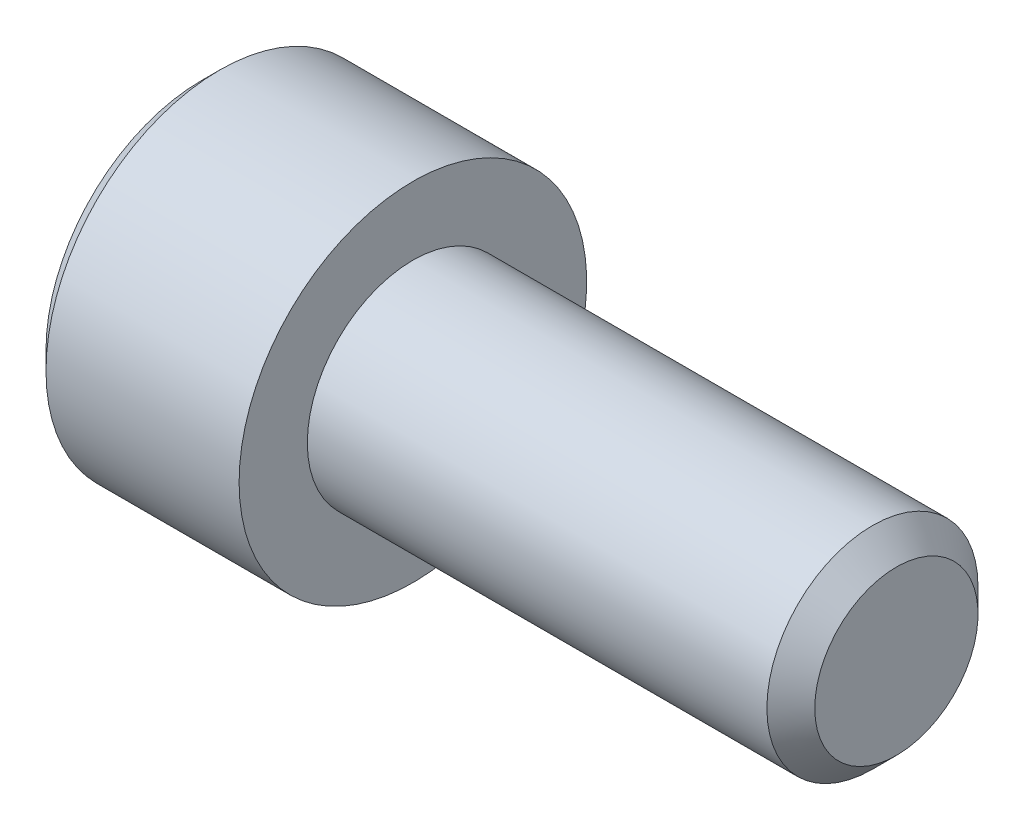
ISO-10303-21;
HEADER;
FILE_DESCRIPTION(('STEP AP214'),'2;1');
FILE_NAME('part.step','',(''),(''),'','','');
FILE_SCHEMA(('AUTOMOTIVE_DESIGN { 1 0 10303 214 1 1 1 1 }'));
ENDSEC;
DATA;
#1=APPLICATION_CONTEXT('core data for automotive mechanical design processes');
#2=APPLICATION_PROTOCOL_DEFINITION('international standard','automotive_design',2000,#1);
#3=PRODUCT_CONTEXT('',#1,'mechanical');
#4=PRODUCT('Part','Part','',(#3));
#5=PRODUCT_RELATED_PRODUCT_CATEGORY('part','',(#4));
#6=PRODUCT_DEFINITION_FORMATION('','',#4);
#7=PRODUCT_DEFINITION_CONTEXT('part definition',#1,'design');
#8=PRODUCT_DEFINITION('design','',#6,#7);
#9=PRODUCT_DEFINITION_SHAPE('','',#8);
#10=(LENGTH_UNIT() NAMED_UNIT(*) SI_UNIT(.MILLI.,.METRE.));
#11=(NAMED_UNIT(*) PLANE_ANGLE_UNIT() SI_UNIT($,.RADIAN.));
#12=(NAMED_UNIT(*) SI_UNIT($,.STERADIAN.) SOLID_ANGLE_UNIT());
#13=UNCERTAINTY_MEASURE_WITH_UNIT(LENGTH_MEASURE(1.E-05),#10,'distance_accuracy_value','');
#14=(GEOMETRIC_REPRESENTATION_CONTEXT(3) GLOBAL_UNCERTAINTY_ASSIGNED_CONTEXT((#13)) GLOBAL_UNIT_ASSIGNED_CONTEXT((#10,
#11,#12)) REPRESENTATION_CONTEXT('',''));
#15=CARTESIAN_POINT('',(0.,0.,0.));
#16=DIRECTION('',(0.,0.,1.));
#17=DIRECTION('',(1.,0.,0.));
#18=AXIS2_PLACEMENT_3D('',#15,#16,#17);
#19=CARTESIAN_POINT('',(-2.21694374982917,0.,0.));
#20=DIRECTION('',(-1.,0.,0.));
#21=DIRECTION('',(0.,0.,1.));
#22=AXIS2_PLACEMENT_3D('',#19,#20,#21);
#23=CONICAL_SURFACE('',#22,2.07459633060125,1.04719755102264);
#24=CARTESIAN_POINT('',(-1.01917499975457,0.,-2.27373675443232E-10));
#25=VERTEX_POINT('',#24);
#26=VERTEX_LOOP('',#25);
#27=FACE_BOUND('',#26,.T.);
#28=CARTESIAN_POINT('',(-2.2097999998902,1.09725896522129E-11,-2.06222299275537));
#29=CARTESIAN_POINT('',(-2.18363203744138,0.0784811371108861,-2.01691188712442));
#30=CARTESIAN_POINT('',(-2.15983364512322,0.157639722270298,-1.97120965667397));
#31=CARTESIAN_POINT('',(-2.11829426610016,0.317327470541627,-1.87901389222323));
#32=CARTESIAN_POINT('',(-2.10056797284901,0.397859470072181,-1.83251872061588));
#33=CARTESIAN_POINT('',(-2.07297571942376,0.557925476432116,-1.74010456875587));
#34=CARTESIAN_POINT('',(-2.06292609609855,0.637434861953671,-1.6941998036219));
#35=CARTESIAN_POINT('',(-2.05093118668194,0.796827555740842,-1.60217438895701));
#36=CARTESIAN_POINT('',(-2.04897596538542,0.876710285054878,-1.55605407368395));
#37=CARTESIAN_POINT('',(-2.05305388237055,1.02596259515888,-1.46988321226823));
#38=CARTESIAN_POINT('',(-2.05808575687008,1.09535457247395,-1.42981973548578));
#39=CARTESIAN_POINT('',(-2.07403062072086,1.23368646100672,-1.34995378240387));
#40=CARTESIAN_POINT('',(-2.0849490514755,1.30262589412846,-1.31015158213326));
#41=CARTESIAN_POINT('',(-2.11224301510014,1.44124275939744,-1.23012109765599));
#42=CARTESIAN_POINT('',(-2.12873419131745,1.51090265655993,-1.1899029372775));
#43=CARTESIAN_POINT('',(-2.1661621894439,1.64918377401521,-1.11006629689085));
#44=CARTESIAN_POINT('',(-2.18709022290799,1.71780676448237,-1.07044679487204));
#45=CARTESIAN_POINT('',(-2.20979999989728,1.78593750001027,-1.03111149637492));
#46=B_SPLINE_CURVE_WITH_KNOTS('',3,(#28,#29,#30,#31,#32,#33,#34,#35,#36,#37,#38,#39,#40,#41,#42,
#43,#44,#45),.UNSPECIFIED.,.F.,.F.,(4,2,2,2,2,2,2,2,4),(0.,0.283085391587975,0.566851041335249,
0.84359437023131,1.11999791881968,1.36062343407243,1.60147176059153,1.8476609488634,
2.09336697168605),.UNSPECIFIED.);
#47=CARTESIAN_POINT('',(-2.20979999988995,-4.62298986547413E-12,-2.0622229927381));
#48=VERTEX_POINT('',#47);
#49=CARTESIAN_POINT('',(-2.20979999989872,1.78593750000579,-1.03111149638766));
#50=VERTEX_POINT('',#49);
#51=EDGE_CURVE('E171',#48,#50,#46,.T.);
#52=ORIENTED_EDGE('',*,*,#51,.F.);
#53=CARTESIAN_POINT('',(-2.20979999990519,-1.78593750000782,-1.03111149636406));
#54=CARTESIAN_POINT('',(-2.18363203745135,-1.70745636291131,-1.0764226020009));
#55=CARTESIAN_POINT('',(-2.1598336451306,-1.62829777775272,-1.12212483245411));
#56=CARTESIAN_POINT('',(-2.11829426610459,-1.46861002948081,-1.21432059690755));
#57=CARTESIAN_POINT('',(-2.10056797285306,-1.38807802994883,-1.26081576851484));
#58=CARTESIAN_POINT('',(-2.07297571942659,-1.22801202358675,-1.35322992037548));
#59=CARTESIAN_POINT('',(-2.06292609610054,-1.14850263806446,-1.3991346855101));
#60=CARTESIAN_POINT('',(-2.05093118668254,-0.989109944275587,-1.49116010017613));
#61=CARTESIAN_POINT('',(-2.04897596538548,-0.909227214960583,-1.53728041544968));
#62=CARTESIAN_POINT('',(-2.05305388236971,-0.759974904856102,-1.62345127686564));
#63=CARTESIAN_POINT('',(-2.05808575686875,-0.690582927541512,-1.66351475364783));
#64=CARTESIAN_POINT('',(-2.07403062071851,-0.55225103900968,-1.74338070672921));
#65=CARTESIAN_POINT('',(-2.08494905147262,-0.483311605888391,-1.78318290699956));
#66=CARTESIAN_POINT('',(-2.11224301509619,-0.344694740620254,-1.86321339147634));
#67=CARTESIAN_POINT('',(-2.12873419131297,-0.275034843458156,-1.9034315518546));
#68=CARTESIAN_POINT('',(-2.16616218943838,-0.136753726003615,-1.98326819224082));
#69=CARTESIAN_POINT('',(-2.18709022290197,-0.0681307355368011,-2.02288769425943));
#70=CARTESIAN_POINT('',(-2.20979999989077,-9.24720308734519E-12,-2.06222299275635));
#71=B_SPLINE_CURVE_WITH_KNOTS('',3,(#53,#54,#55,#56,#57,#58,#59,#60,#61,#62,#63,#64,#65,#66,#67,
#68,#69,#70),.UNSPECIFIED.,.F.,.F.,(4,2,2,2,2,2,2,2,4),(0.,0.283085391591813,0.566851041342766,
0.843594370242013,1.11999791883364,1.36062343408466,1.60147176060198,1.84766094887221,
2.0933669716933),.UNSPECIFIED.);
#72=CARTESIAN_POINT('',(-2.20979999989676,-1.78593750000737,-1.03111149637815));
#73=VERTEX_POINT('',#72);
#74=EDGE_CURVE('E21',#73,#48,#71,.T.);
#75=ORIENTED_EDGE('',*,*,#74,.F.);
#76=CARTESIAN_POINT('',(-2.20979999990561,-1.78593749998911,1.03111149639684));
#77=CARTESIAN_POINT('',(-2.18363203745164,-1.78593749999609,0.94048928513493));
#78=CARTESIAN_POINT('',(-2.15983364513082,-1.78593749999895,0.849084824233336));
#79=CARTESIAN_POINT('',(-2.11829426610471,-1.78593750000105,0.664693295329928));
#80=CARTESIAN_POINT('',(-2.10056797285318,-1.78593750000028,0.571702952113989));
#81=CARTESIAN_POINT('',(-2.07297571942667,-1.78593749999973,0.386874648391726));
#82=CARTESIAN_POINT('',(-2.0629260961006,-1.78593749999993,0.295065118122805));
#83=CARTESIAN_POINT('',(-2.05093118668256,-1.78593750000007,0.111014288790957));
#84=CARTESIAN_POINT('',(-2.04897596538548,-1.78593750000002,0.0187736582437296));
#85=CARTESIAN_POINT('',(-2.05305388236974,-1.78593749999998,-0.153568064590571));
#86=CARTESIAN_POINT('',(-2.058085756869,-1.7859375,-0.233695018157239));
#87=CARTESIAN_POINT('',(-2.07403062071954,-1.7859375,-0.393426924324539));
#88=CARTESIAN_POINT('',(-2.08494905147419,-1.7859375,-0.473031324867516));
#89=CARTESIAN_POINT('',(-2.11224301509914,-1.7859375,-0.633092293825662));
#90=CARTESIAN_POINT('',(-2.12873419131676,-1.7859375,-0.713528614584499));
#91=CARTESIAN_POINT('',(-2.16616218944403,-1.7859375,-0.873201895361495));
#92=CARTESIAN_POINT('',(-2.18709022290864,-1.7859375,-0.952440899400956));
#93=CARTESIAN_POINT('',(-2.20979999989852,-1.7859375,-1.031111496397));
#94=B_SPLINE_CURVE_WITH_KNOTS('',3,(#76,#77,#78,#79,#80,#81,#82,#83,#84,#85,#86,#87,#88,#89,#90,
#91,#92,#93),.UNSPECIFIED.,.F.,.F.,(4,2,2,2,2,2,2,2,4),(0.,0.283085391591947,0.566851041343033,
0.843594370242341,1.11999791883402,1.36062343409196,1.60147176061623,1.84766094889376,
2.09336697172211),.UNSPECIFIED.);
#95=CARTESIAN_POINT('',(-2.2097999998989,-1.78593750000737,1.03111149638554));
#96=VERTEX_POINT('',#95);
#97=EDGE_CURVE('E95',#96,#73,#94,.T.);
#98=ORIENTED_EDGE('',*,*,#97,.F.);
#99=CARTESIAN_POINT('',(-2.20979999991607,3.12057355636284E-11,2.06222299275177));
#100=CARTESIAN_POINT('',(-2.1836320374565,-0.0784811370760846,2.01691188713447));
#101=CARTESIAN_POINT('',(-2.15983364513316,-0.157639722239571,1.97120965668901));
#102=CARTESIAN_POINT('',(-2.11829426610485,-0.317327470516074,1.87901389224068));
#103=CARTESIAN_POINT('',(-2.10056797285361,-0.397859470047716,1.83251872063072));
#104=CARTESIAN_POINT('',(-2.07297571942713,-0.557925476410414,1.7401045687677));
#105=CARTESIAN_POINT('',(-2.06292609610077,-0.637434861933618,1.69419980363329));
#106=CARTESIAN_POINT('',(-2.05093118668249,-0.796827555723997,1.60217438896692));
#107=CARTESIAN_POINT('',(-2.04897596538545,-0.876710285039592,1.55605407369282));
#108=CARTESIAN_POINT('',(-2.05305388236982,-1.0259625951465,1.46988321227534));
#109=CARTESIAN_POINT('',(-2.05808575686909,-1.0953545724629,1.42981973549214));
#110=CARTESIAN_POINT('',(-2.07403062071961,-1.2336864609983,1.34995378240874));
#111=CARTESIAN_POINT('',(-2.08494905147424,-1.30262589412133,1.31015158213737));
#112=CARTESIAN_POINT('',(-2.11224301509913,-1.44124275939309,1.2301210976585));
#113=CARTESIAN_POINT('',(-2.12873419131671,-1.51090265655705,1.18990293727916));
#114=CARTESIAN_POINT('',(-2.16616218944389,-1.64918377401529,1.11006629689081));
#115=CARTESIAN_POINT('',(-2.18709022290845,-1.71780676448393,1.07044679487115));
#116=CARTESIAN_POINT('',(-2.20979999989828,-1.78593750001328,1.03111149637318));
#117=B_SPLINE_CURVE_WITH_KNOTS('',3,(#99,#100,#101,#102,#103,#104,#105,#106,#107,#108,#109,#110,
#111,#112,#113,#114,#115,#116),.UNSPECIFIED.,.F.,.F.,(4,2,2,2,2,2,2,2,4),(0.,0.28308539159484,
0.566851041348576,0.843594370250035,1.11999791884397,1.36062343410124,1.60147176062477,
1.84766094890181,2.09336697172975),.UNSPECIFIED.);
#118=CARTESIAN_POINT('',(-2.20979999989529,1.13804215653077E-11,2.06222299274735));
#119=VERTEX_POINT('',#118);
#120=EDGE_CURVE('E137',#119,#96,#117,.T.);
#121=ORIENTED_EDGE('',*,*,#120,.F.);
#122=CARTESIAN_POINT('',(-2.2097999999056,1.7859375000084,1.03111149636342));
#123=CARTESIAN_POINT('',(-2.18363203745163,1.70745636291196,1.07642260200042));
#124=CARTESIAN_POINT('',(-2.15983364513081,1.62829777775339,1.12212483245369));
#125=CARTESIAN_POINT('',(-2.11829426610471,1.46861002948143,1.21432059690722));
#126=CARTESIAN_POINT('',(-2.10056797285317,1.38807802994941,1.26081576851452));
#127=CARTESIAN_POINT('',(-2.07297571942667,1.22801202358727,1.35322992037517));
#128=CARTESIAN_POINT('',(-2.06292609610059,1.14850263806497,1.3991346855098));
#129=CARTESIAN_POINT('',(-2.05093118668256,0.989109944276064,1.49116010017585));
#130=CARTESIAN_POINT('',(-2.04897596538548,0.909227214961045,1.53728041544942));
#131=CARTESIAN_POINT('',(-2.05305388236974,0.759974904854406,1.62345127686662));
#132=CARTESIAN_POINT('',(-2.05808575686902,0.69058292753768,1.66351475365005));
#133=CARTESIAN_POINT('',(-2.07403062071961,0.55225103900161,1.74338070673387));
#134=CARTESIAN_POINT('',(-2.08494905147431,0.48331160587822,1.78318290700543));
#135=CARTESIAN_POINT('',(-2.11224301509936,0.34469474060583,1.86321339148466));
#136=CARTESIAN_POINT('',(-2.12873419131703,0.275034843441581,1.90343155186417));
#137=CARTESIAN_POINT('',(-2.16616218944444,0.136753725982819,1.98326819225283));
#138=CARTESIAN_POINT('',(-2.18709022290912,0.0681307355139321,2.02288769427264));
#139=CARTESIAN_POINT('',(-2.20979999989908,-1.56654331860135E-11,2.06222299277073));
#140=B_SPLINE_CURVE_WITH_KNOTS('',3,(#122,#123,#124,#125,#126,#127,#128,#129,#130,#131,#132,
#133,#134,#135,#136,#137,#138,#139),.UNSPECIFIED.,.F.,.F.,(4,2,2,2,2,2,2,2,4),(0.,
0.283085391591948,0.566851041343036,0.843594370242341,1.11999791883402,1.36062343409245,
1.60147176061721,1.84766094889526,2.09336697172412),.UNSPECIFIED.);
#141=CARTESIAN_POINT('',(-2.20979999989889,1.78593750000775,1.03111149638488));
#142=VERTEX_POINT('',#141);
#143=EDGE_CURVE('E159',#142,#119,#140,.T.);
#144=ORIENTED_EDGE('',*,*,#143,.F.);
#145=CARTESIAN_POINT('',(-2.20979999990673,1.78593749998839,-1.03111149639912));
#146=CARTESIAN_POINT('',(-2.18363203745242,1.78593749999583,-0.940489285137205));
#147=CARTESIAN_POINT('',(-2.15983364513141,1.78593749999888,-0.84908482423556));
#148=CARTESIAN_POINT('',(-2.11829426610509,1.78593750000112,-0.664693295332012));
#149=CARTESIAN_POINT('',(-2.10056797285351,1.7859375000003,-0.571702952115983));
#150=CARTESIAN_POINT('',(-2.07297571942691,1.78593749999971,-0.386874648393559));
#151=CARTESIAN_POINT('',(-2.06292609610076,1.78593749999992,-0.295065118124566));
#152=CARTESIAN_POINT('',(-2.05093118668262,1.78593750000008,-0.111014288792565));
#153=CARTESIAN_POINT('',(-2.04897596538549,1.78593750000002,-0.0187736582452566));
#154=CARTESIAN_POINT('',(-2.05305388236967,1.78593749999998,0.153568064589173));
#155=CARTESIAN_POINT('',(-2.0580857568689,1.7859375,0.233695018155889));
#156=CARTESIAN_POINT('',(-2.07403062071938,1.78593750000001,0.393426924323285));
#157=CARTESIAN_POINT('',(-2.08494905147402,1.7859375,0.47303132486631));
#158=CARTESIAN_POINT('',(-2.11224301509893,1.7859375,0.63309229382456));
#159=CARTESIAN_POINT('',(-2.12873419131654,1.7859375,0.713528614583453));
#160=CARTESIAN_POINT('',(-2.16616218944379,1.7859375,0.873201895360561));
#161=CARTESIAN_POINT('',(-2.1870902229084,1.7859375,0.952440899400077));
#162=CARTESIAN_POINT('',(-2.20979999989828,1.7859375,1.03111149639618));
#163=B_SPLINE_CURVE_WITH_KNOTS('',3,(#145,#146,#147,#148,#149,#150,#151,#152,#153,#154,#155,
#156,#157,#158,#159,#160,#161,#162),.UNSPECIFIED.,.F.,.F.,(4,2,2,2,2,2,2,2,4),(0.,
0.283085391592233,0.566851041343597,0.843594370243144,1.11999791883507,1.36062343409315,
1.60147176061755,1.84766094889524,2.09336697172374),.UNSPECIFIED.);
#164=EDGE_CURVE('E166',#50,#142,#163,.T.);
#165=ORIENTED_EDGE('',*,*,#164,.F.);
#166=EDGE_LOOP('',(#52,#75,#98,#121,#144,#165));
#167=FACE_BOUND('',#166,.T.);
#168=ADVANCED_FACE('F17',(#27,#167),#23,.F.);
#169=CARTESIAN_POINT('',(0.,0.,-2.06222299276169));
#170=DIRECTION('',(0.,0.5,0.866025403784439));
#171=DIRECTION('',(0.,-0.866025403784439,0.5));
#172=AXIS2_PLACEMENT_3D('',#169,#170,#171);
#173=PLANE('',#172);
#174=ORIENTED_EDGE('',*,*,#74,.T.);
#175=DIRECTION('',(1.,0.,0.));
#176=VECTOR('',#175,1.);
#177=CARTESIAN_POINT('',(0.,0.,-2.0622229927617));
#178=LINE('',#177,#176);
#179=CARTESIAN_POINT('',(-4.1656,-1.85466870176759E-12,-2.06222299276134));
#180=VERTEX_POINT('',#179);
#181=EDGE_CURVE('E84',#180,#48,#178,.T.);
#182=ORIENTED_EDGE('',*,*,#181,.F.);
#183=DIRECTION('',(0.,0.866025403784438,-0.500000000000001));
#184=VECTOR('',#183,1.);
#185=CARTESIAN_POINT('',(-4.1656,-1.7859375,-1.03111149638085));
#186=LINE('',#185,#184);
#187=CARTESIAN_POINT('',(-4.1656,-1.7859375,-1.03111149638397));
#188=VERTEX_POINT('',#187);
#189=EDGE_CURVE('E78',#188,#180,#186,.T.);
#190=ORIENTED_EDGE('',*,*,#189,.F.);
#191=DIRECTION('',(1.,0.,0.));
#192=VECTOR('',#191,1.);
#193=CARTESIAN_POINT('',(0.,-1.7859375,-1.03111149638397));
#194=LINE('',#193,#192);
#195=EDGE_CURVE('E81',#73,#188,#194,.F.);
#196=ORIENTED_EDGE('',*,*,#195,.F.);
#197=EDGE_LOOP('',(#174,#182,#190,#196));
#198=FACE_BOUND('',#197,.T.);
#199=ADVANCED_FACE('F80',(#198),#173,.T.);
#200=CARTESIAN_POINT('',(0.,1.7859375,-1.03111149638085));
#201=DIRECTION('',(0.,-0.500000000000001,0.866025403784438));
#202=DIRECTION('',(0.,-0.866025403784438,-0.500000000000001));
#203=AXIS2_PLACEMENT_3D('',#200,#201,#202);
#204=PLANE('',#203);
#205=ORIENTED_EDGE('',*,*,#51,.T.);
#206=DIRECTION('',(1.,0.,0.));
#207=VECTOR('',#206,1.);
#208=CARTESIAN_POINT('',(0.,1.7859375,-1.03111149638085));
#209=LINE('',#208,#207);
#210=CARTESIAN_POINT('',(-4.1656,1.7859375,-1.03111149638124));
#211=VERTEX_POINT('',#210);
#212=EDGE_CURVE('E170',#211,#50,#209,.T.);
#213=ORIENTED_EDGE('',*,*,#212,.F.);
#214=DIRECTION('',(0.,0.866025403784438,0.500000000000001));
#215=VECTOR('',#214,1.);
#216=CARTESIAN_POINT('',(-4.1656,0.,-2.0622229927617));
#217=LINE('',#216,#215);
#218=EDGE_CURVE('E89',#180,#211,#217,.T.);
#219=ORIENTED_EDGE('',*,*,#218,.F.);
#220=ORIENTED_EDGE('',*,*,#181,.T.);
#221=EDGE_LOOP('',(#205,#213,#219,#220));
#222=FACE_BOUND('',#221,.T.);
#223=ADVANCED_FACE('F175',(#222),#204,.T.);
#224=CARTESIAN_POINT('',(0.,1.7859375,1.03111149638085));
#225=DIRECTION('',(0.,-1.,0.));
#226=DIRECTION('',(1.,0.,0.));
#227=AXIS2_PLACEMENT_3D('',#224,#225,#226);
#228=PLANE('',#227);
#229=ORIENTED_EDGE('',*,*,#164,.T.);
#230=DIRECTION('',(1.,0.,0.));
#231=VECTOR('',#230,1.);
#232=CARTESIAN_POINT('',(0.,1.7859375,1.03111149638084));
#233=LINE('',#232,#231);
#234=CARTESIAN_POINT('',(-4.1656,1.78593749999966,1.03111149638104));
#235=VERTEX_POINT('',#234);
#236=EDGE_CURVE('E165',#235,#142,#233,.T.);
#237=ORIENTED_EDGE('',*,*,#236,.F.);
#238=DIRECTION('',(0.,0.,1.));
#239=VECTOR('',#238,1.);
#240=CARTESIAN_POINT('',(-4.1656,1.7859375,1.5367));
#241=LINE('',#240,#239);
#242=EDGE_CURVE('E116',#211,#235,#241,.T.);
#243=ORIENTED_EDGE('',*,*,#242,.F.);
#244=ORIENTED_EDGE('',*,*,#212,.T.);
#245=EDGE_LOOP('',(#229,#237,#243,#244));
#246=FACE_BOUND('',#245,.T.);
#247=ADVANCED_FACE('F155',(#246),#228,.T.);
#248=CARTESIAN_POINT('',(0.,0.,2.06222299276169));
#249=DIRECTION('',(0.,-0.5,-0.866025403784439));
#250=DIRECTION('',(0.,0.866025403784439,-0.5));
#251=AXIS2_PLACEMENT_3D('',#248,#249,#250);
#252=PLANE('',#251);
#253=ORIENTED_EDGE('',*,*,#143,.T.);
#254=DIRECTION('',(1.,0.,0.));
#255=VECTOR('',#254,1.);
#256=CARTESIAN_POINT('',(0.,0.,2.0622229927617));
#257=LINE('',#256,#255);
#258=CARTESIAN_POINT('',(-4.1656,-2.1496867881859E-12,2.06222299276045));
#259=VERTEX_POINT('',#258);
#260=EDGE_CURVE('E164',#259,#119,#257,.T.);
#261=ORIENTED_EDGE('',*,*,#260,.F.);
#262=DIRECTION('',(0.,-0.866025403784439,0.499999999999999));
#263=VECTOR('',#262,1.);
#264=CARTESIAN_POINT('',(-4.1656,1.7859375,1.03111149638085));
#265=LINE('',#264,#263);
#266=EDGE_CURVE('E106',#235,#259,#265,.T.);
#267=ORIENTED_EDGE('',*,*,#266,.F.);
#268=ORIENTED_EDGE('',*,*,#236,.T.);
#269=EDGE_LOOP('',(#253,#261,#267,#268));
#270=FACE_BOUND('',#269,.T.);
#271=ADVANCED_FACE('F151',(#270),#252,.T.);
#272=CARTESIAN_POINT('',(0.,-1.7859375,1.03111149638085));
#273=DIRECTION('',(0.,0.5,-0.866025403784439));
#274=DIRECTION('',(0.,0.866025403784439,0.5));
#275=AXIS2_PLACEMENT_3D('',#272,#273,#274);
#276=PLANE('',#275);
#277=ORIENTED_EDGE('',*,*,#120,.T.);
#278=DIRECTION('',(1.,0.,0.));
#279=VECTOR('',#278,1.);
#280=CARTESIAN_POINT('',(0.,-1.7859375,1.03111149638085));
#281=LINE('',#280,#279);
#282=CARTESIAN_POINT('',(-4.1656,-1.7859375,1.03111149638046));
#283=VERTEX_POINT('',#282);
#284=EDGE_CURVE('E39',#283,#96,#281,.T.);
#285=ORIENTED_EDGE('',*,*,#284,.F.);
#286=DIRECTION('',(0.,-0.866025403784439,-0.499999999999998));
#287=VECTOR('',#286,1.);
#288=CARTESIAN_POINT('',(-4.1656,0.,2.06222299276169));
#289=LINE('',#288,#287);
#290=EDGE_CURVE('E100',#259,#283,#289,.T.);
#291=ORIENTED_EDGE('',*,*,#290,.F.);
#292=ORIENTED_EDGE('',*,*,#260,.T.);
#293=EDGE_LOOP('',(#277,#285,#291,#292));
#294=FACE_BOUND('',#293,.T.);
#295=ADVANCED_FACE('F146',(#294),#276,.T.);
#296=CARTESIAN_POINT('',(0.,-1.7859375,-1.03111149638085));
#297=DIRECTION('',(0.,1.,0.));
#298=DIRECTION('',(0.,0.,1.));
#299=AXIS2_PLACEMENT_3D('',#296,#297,#298);
#300=PLANE('',#299);
#301=ORIENTED_EDGE('',*,*,#97,.T.);
#302=ORIENTED_EDGE('',*,*,#195,.T.);
#303=DIRECTION('',(0.,0.,1.));
#304=VECTOR('',#303,1.);
#305=CARTESIAN_POINT('',(-4.1656,-1.7859375,1.5367));
#306=LINE('',#305,#304);
#307=EDGE_CURVE('E93',#283,#188,#306,.F.);
#308=ORIENTED_EDGE('',*,*,#307,.F.);
#309=ORIENTED_EDGE('',*,*,#284,.T.);
#310=EDGE_LOOP('',(#301,#302,#308,#309));
#311=FACE_BOUND('',#310,.T.);
#312=ADVANCED_FACE('F92',(#311),#300,.T.);
#313=CARTESIAN_POINT('',(-4.1656,0.,1.5367));
#314=DIRECTION('',(-1.,0.,0.));
#315=DIRECTION('',(0.,0.,1.));
#316=AXIS2_PLACEMENT_3D('',#313,#314,#315);
#317=PLANE('',#316);
#318=ORIENTED_EDGE('',*,*,#290,.T.);
#319=ORIENTED_EDGE('',*,*,#307,.T.);
#320=ORIENTED_EDGE('',*,*,#189,.T.);
#321=ORIENTED_EDGE('',*,*,#218,.T.);
#322=ORIENTED_EDGE('',*,*,#242,.T.);
#323=ORIENTED_EDGE('',*,*,#266,.T.);
#324=EDGE_LOOP('',(#318,#319,#320,#321,#322,#323));
#325=FACE_BOUND('',#324,.T.);
#326=CARTESIAN_POINT('',(-4.16560000002164,0.,0.));
#327=DIRECTION('',(1.,0.,0.));
#328=DIRECTION('',(0.,0.,-1.));
#329=AXIS2_PLACEMENT_3D('',#326,#327,#328);
#330=CIRCLE('',#329,3.07340000006206);
#331=CARTESIAN_POINT('',(-4.16560000002164,0.,-3.07340000006207));
#332=VERTEX_POINT('',#331);
#333=EDGE_CURVE('E101',#332,#332,#330,.T.);
#334=ORIENTED_EDGE('',*,*,#333,.F.);
#335=EDGE_LOOP('',(#334));
#336=FACE_BOUND('',#335,.T.);
#337=ADVANCED_FACE('F97',(#325,#336),#317,.T.);
#338=CARTESIAN_POINT('',(-3.81000000004406,0.,0.));
#339=DIRECTION('',(1.,0.,0.));
#340=DIRECTION('',(0.,0.,-1.));
#341=AXIS2_PLACEMENT_3D('',#338,#339,#340);
#342=CONICAL_SURFACE('',#341,3.42900000009649,0.785398163477374);
#343=ORIENTED_EDGE('',*,*,#333,.T.);
#344=EDGE_LOOP('',(#343));
#345=FACE_BOUND('',#344,.T.);
#346=CARTESIAN_POINT('',(-3.81000000010548,0.,0.));
#347=DIRECTION('',(-1.,0.,0.));
#348=DIRECTION('',(0.,0.,1.));
#349=AXIS2_PLACEMENT_3D('',#346,#347,#348);
#350=CIRCLE('',#349,3.429);
#351=CARTESIAN_POINT('',(-3.81000000010548,0.,3.429));
#352=VERTEX_POINT('',#351);
#353=EDGE_CURVE('E104',#352,#352,#350,.F.);
#354=ORIENTED_EDGE('',*,*,#353,.F.);
#355=EDGE_LOOP('',(#354));
#356=FACE_BOUND('',#355,.T.);
#357=ADVANCED_FACE('F208',(#345,#356),#342,.T.);
#358=CARTESIAN_POINT('',(9.54024,0.,0.));
#359=DIRECTION('',(1.,0.,0.));
#360=DIRECTION('',(0.,0.,-1.));
#361=AXIS2_PLACEMENT_3D('',#358,#359,#360);
#362=PLANE('',#361);
#363=CARTESIAN_POINT('',(9.54024000009213,0.,0.));
#364=DIRECTION('',(-1.,0.,0.));
#365=DIRECTION('',(0.,0.,1.));
#366=AXIS2_PLACEMENT_3D('',#363,#364,#365);
#367=CIRCLE('',#366,1.61036000002923);
#368=CARTESIAN_POINT('',(9.54024000009213,0.,1.61036000002923));
#369=VERTEX_POINT('',#368);
#370=EDGE_CURVE('E129',#369,#369,#367,.T.);
#371=ORIENTED_EDGE('',*,*,#370,.F.);
#372=EDGE_LOOP('',(#371));
#373=FACE_BOUND('',#372,.T.);
#374=ADVANCED_FACE('F205',(#373),#362,.T.);
#375=CARTESIAN_POINT('',(-1.905,0.,0.));
#376=DIRECTION('',(-1.,0.,0.));
#377=DIRECTION('',(0.,0.,1.));
#378=AXIS2_PLACEMENT_3D('',#375,#376,#377);
#379=CYLINDRICAL_SURFACE('',#378,3.429);
#380=CARTESIAN_POINT('',(0.,0.,0.));
#381=DIRECTION('',(-1.,0.,0.));
#382=DIRECTION('',(0.,0.,1.));
#383=AXIS2_PLACEMENT_3D('',#380,#381,#382);
#384=CIRCLE('',#383,3.429);
#385=CARTESIAN_POINT('',(0.,0.,3.429));
#386=VERTEX_POINT('',#385);
#387=EDGE_CURVE('E126',#386,#386,#384,.F.);
#388=ORIENTED_EDGE('',*,*,#387,.F.);
#389=EDGE_LOOP('',(#388));
#390=FACE_BOUND('',#389,.T.);
#391=ORIENTED_EDGE('',*,*,#353,.T.);
#392=EDGE_LOOP('',(#391));
#393=FACE_BOUND('',#392,.T.);
#394=ADVANCED_FACE('F201',(#390,#393),#379,.T.);
#395=CARTESIAN_POINT('',(9.06780000008212,0.,0.));
#396=DIRECTION('',(-1.,0.,0.));
#397=DIRECTION('',(0.,0.,1.));
#398=AXIS2_PLACEMENT_3D('',#395,#396,#397);
#399=CONICAL_SURFACE('',#398,2.0827999999824,0.785398163337289);
#400=ORIENTED_EDGE('',*,*,#370,.T.);
#401=EDGE_LOOP('',(#400));
#402=FACE_BOUND('',#401,.T.);
#403=CARTESIAN_POINT('',(9.0678,0.,0.));
#404=DIRECTION('',(-1.,0.,0.));
#405=DIRECTION('',(0.,0.,1.));
#406=AXIS2_PLACEMENT_3D('',#403,#404,#405);
#407=CIRCLE('',#406,2.0828);
#408=CARTESIAN_POINT('',(9.0678,0.,2.0828));
#409=VERTEX_POINT('',#408);
#410=EDGE_CURVE('E30',#409,#409,#407,.T.);
#411=ORIENTED_EDGE('',*,*,#410,.F.);
#412=EDGE_LOOP('',(#411));
#413=FACE_BOUND('',#412,.T.);
#414=ADVANCED_FACE('F194',(#402,#413),#399,.T.);
#415=CARTESIAN_POINT('',(0.,0.,1.7145));
#416=DIRECTION('',(1.,0.,0.));
#417=DIRECTION('',(0.,0.,-1.));
#418=AXIS2_PLACEMENT_3D('',#415,#416,#417);
#419=PLANE('',#418);
#420=CARTESIAN_POINT('',(0.,0.,0.));
#421=DIRECTION('',(-1.,0.,0.));
#422=DIRECTION('',(0.,0.,1.));
#423=AXIS2_PLACEMENT_3D('',#420,#421,#422);
#424=CIRCLE('',#423,2.0828);
#425=CARTESIAN_POINT('',(0.,0.,2.0828));
#426=VERTEX_POINT('',#425);
#427=EDGE_CURVE('E11',#426,#426,#424,.F.);
#428=ORIENTED_EDGE('',*,*,#427,.F.);
#429=EDGE_LOOP('',(#428));
#430=FACE_BOUND('',#429,.T.);
#431=ORIENTED_EDGE('',*,*,#387,.T.);
#432=EDGE_LOOP('',(#431));
#433=FACE_BOUND('',#432,.T.);
#434=ADVANCED_FACE('F188',(#430,#433),#419,.T.);
#435=CARTESIAN_POINT('',(9.0678,0.,0.));
#436=DIRECTION('',(-1.,0.,0.));
#437=DIRECTION('',(0.,0.,1.));
#438=AXIS2_PLACEMENT_3D('',#435,#436,#437);
#439=CYLINDRICAL_SURFACE('',#438,2.0828);
#440=ORIENTED_EDGE('',*,*,#427,.T.);
#441=EDGE_LOOP('',(#440));
#442=FACE_BOUND('',#441,.T.);
#443=ORIENTED_EDGE('',*,*,#410,.T.);
#444=EDGE_LOOP('',(#443));
#445=FACE_BOUND('',#444,.T.);
#446=ADVANCED_FACE('F186',(#442,#445),#439,.T.);
#447=CLOSED_SHELL('',(#168,#199,#223,#247,#271,#295,#312,#337,#357,#374,#394,#414,#434,#446));
#448=MANIFOLD_SOLID_BREP('B1',#447);
#449=ADVANCED_BREP_SHAPE_REPRESENTATION('',(#18,#448),#14);
#450=SHAPE_DEFINITION_REPRESENTATION(#9,#449);
ENDSEC;
END-ISO-10303-21;
